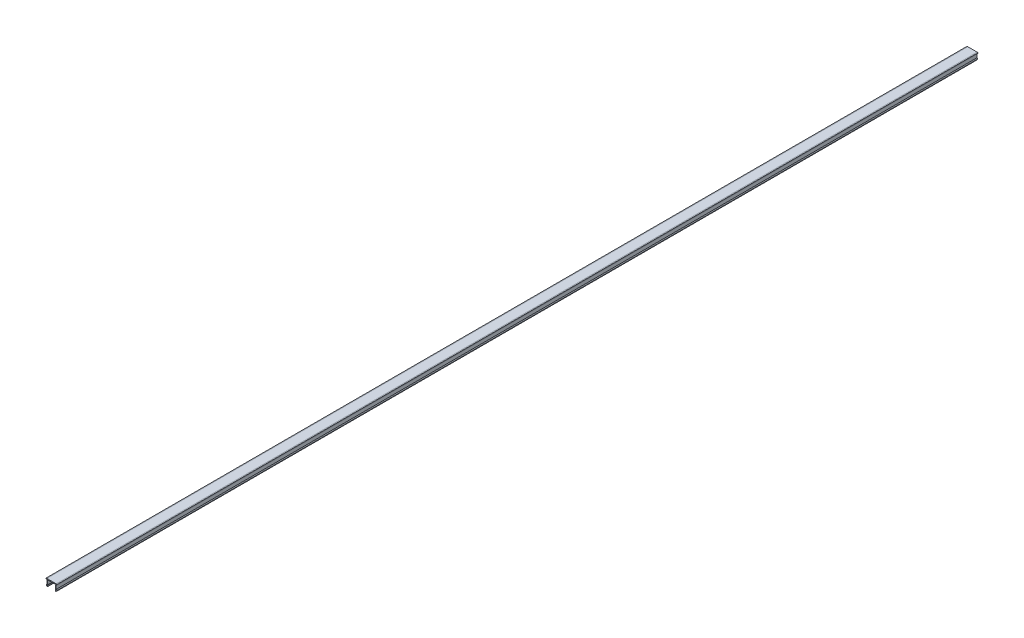
ISO-10303-21;
HEADER;
FILE_DESCRIPTION(('STEP AP214'),'2;1');
FILE_NAME('part.step','',(''),(''),'','','');
FILE_SCHEMA(('AUTOMOTIVE_DESIGN { 1 0 10303 214 1 1 1 1 }'));
ENDSEC;
DATA;
#1=APPLICATION_CONTEXT('core data for automotive mechanical design processes');
#2=APPLICATION_PROTOCOL_DEFINITION('international standard','automotive_design',2000,#1);
#3=PRODUCT_CONTEXT('',#1,'mechanical');
#4=PRODUCT('Part','Part','',(#3));
#5=PRODUCT_RELATED_PRODUCT_CATEGORY('part','',(#4));
#6=PRODUCT_DEFINITION_FORMATION('','',#4);
#7=PRODUCT_DEFINITION_CONTEXT('part definition',#1,'design');
#8=PRODUCT_DEFINITION('design','',#6,#7);
#9=PRODUCT_DEFINITION_SHAPE('','',#8);
#10=(LENGTH_UNIT() NAMED_UNIT(*) SI_UNIT(.MILLI.,.METRE.));
#11=(NAMED_UNIT(*) PLANE_ANGLE_UNIT() SI_UNIT($,.RADIAN.));
#12=(NAMED_UNIT(*) SI_UNIT($,.STERADIAN.) SOLID_ANGLE_UNIT());
#13=UNCERTAINTY_MEASURE_WITH_UNIT(LENGTH_MEASURE(1.E-05),#10,'distance_accuracy_value','');
#14=(GEOMETRIC_REPRESENTATION_CONTEXT(3) GLOBAL_UNCERTAINTY_ASSIGNED_CONTEXT((#13)) GLOBAL_UNIT_ASSIGNED_CONTEXT((#10,
#11,#12)) REPRESENTATION_CONTEXT('',''));
#15=CARTESIAN_POINT('',(0.,0.,0.));
#16=DIRECTION('',(0.,0.,1.));
#17=DIRECTION('',(1.,0.,0.));
#18=AXIS2_PLACEMENT_3D('',#15,#16,#17);
#19=CARTESIAN_POINT('',(-5.1,0.,1000.));
#20=DIRECTION('',(0.,-1.,0.));
#21=DIRECTION('',(1.,0.,0.));
#22=AXIS2_PLACEMENT_3D('',#19,#20,#21);
#23=PLANE('',#22);
#24=DIRECTION('',(-1.,0.,0.));
#25=VECTOR('',#24,1.);
#26=CARTESIAN_POINT('',(-5.1,0.,0.));
#27=LINE('',#26,#25);
#28=CARTESIAN_POINT('',(5.1,0.,0.));
#29=VERTEX_POINT('',#28);
#30=CARTESIAN_POINT('',(-5.1,0.,0.));
#31=VERTEX_POINT('',#30);
#32=EDGE_CURVE('E215',#29,#31,#27,.T.);
#33=ORIENTED_EDGE('',*,*,#32,.T.);
#34=DIRECTION('',(0.,0.,-1.));
#35=VECTOR('',#34,1.);
#36=CARTESIAN_POINT('',(-5.1,0.,1000.));
#37=LINE('',#36,#35);
#38=CARTESIAN_POINT('',(-5.1,0.,1000.));
#39=VERTEX_POINT('',#38);
#40=EDGE_CURVE('E11',#39,#31,#37,.T.);
#41=ORIENTED_EDGE('',*,*,#40,.F.);
#42=DIRECTION('',(-1.,0.,0.));
#43=VECTOR('',#42,1.);
#44=CARTESIAN_POINT('',(-5.1,0.,1000.));
#45=LINE('',#44,#43);
#46=CARTESIAN_POINT('',(5.1,0.,1000.));
#47=VERTEX_POINT('',#46);
#48=EDGE_CURVE('E257',#47,#39,#45,.T.);
#49=ORIENTED_EDGE('',*,*,#48,.F.);
#50=DIRECTION('',(0.,0.,-1.));
#51=VECTOR('',#50,1.);
#52=CARTESIAN_POINT('',(5.1,0.,1000.));
#53=LINE('',#52,#51);
#54=EDGE_CURVE('E211',#47,#29,#53,.T.);
#55=ORIENTED_EDGE('',*,*,#54,.T.);
#56=EDGE_LOOP('',(#33,#41,#49,#55));
#57=FACE_BOUND('',#56,.T.);
#58=ADVANCED_FACE('F35',(#57),#23,.F.);
#59=CARTESIAN_POINT('',(-5.1,0.,1000.));
#60=DIRECTION('',(0.173648177666924,-0.984807753012209,0.));
#61=DIRECTION('',(0.984807753012209,0.173648177666924,0.));
#62=AXIS2_PLACEMENT_3D('',#59,#60,#61);
#63=PLANE('',#62);
#64=DIRECTION('',(-0.984807753012209,-0.173648177666924,0.));
#65=VECTOR('',#64,1.);
#66=CARTESIAN_POINT('',(-5.1,0.,0.));
#67=LINE('',#66,#65);
#68=CARTESIAN_POINT('',(-6.,-0.158694282637612,0.));
#69=VERTEX_POINT('',#68);
#70=EDGE_CURVE('E218',#31,#69,#67,.T.);
#71=ORIENTED_EDGE('',*,*,#70,.T.);
#72=DIRECTION('',(0.,0.,-1.));
#73=VECTOR('',#72,1.);
#74=CARTESIAN_POINT('',(-6.,-0.158694282637612,1000.));
#75=LINE('',#74,#73);
#76=CARTESIAN_POINT('',(-6.,-0.158694282637612,1000.));
#77=VERTEX_POINT('',#76);
#78=EDGE_CURVE('E43',#77,#69,#75,.T.);
#79=ORIENTED_EDGE('',*,*,#78,.F.);
#80=DIRECTION('',(-0.984807753012209,-0.173648177666924,0.));
#81=VECTOR('',#80,1.);
#82=CARTESIAN_POINT('',(-5.1,0.,1000.));
#83=LINE('',#82,#81);
#84=EDGE_CURVE('E136',#39,#77,#83,.T.);
#85=ORIENTED_EDGE('',*,*,#84,.F.);
#86=ORIENTED_EDGE('',*,*,#40,.T.);
#87=EDGE_LOOP('',(#71,#79,#85,#86));
#88=FACE_BOUND('',#87,.T.);
#89=ADVANCED_FACE('F385',(#88),#63,.F.);
#90=CARTESIAN_POINT('',(-6.,-0.158694282637612,1000.));
#91=DIRECTION('',(1.,0.,0.));
#92=DIRECTION('',(0.,0.,-1.));
#93=AXIS2_PLACEMENT_3D('',#90,#91,#92);
#94=PLANE('',#93);
#95=DIRECTION('',(0.,-1.,0.));
#96=VECTOR('',#95,1.);
#97=CARTESIAN_POINT('',(-6.,-0.158694282637612,0.));
#98=LINE('',#97,#96);
#99=CARTESIAN_POINT('',(-6.,-0.8,0.));
#100=VERTEX_POINT('',#99);
#101=EDGE_CURVE('E220',#69,#100,#98,.T.);
#102=ORIENTED_EDGE('',*,*,#101,.T.);
#103=DIRECTION('',(0.,0.,-1.));
#104=VECTOR('',#103,1.);
#105=CARTESIAN_POINT('',(-6.,-0.8,1000.));
#106=LINE('',#105,#104);
#107=CARTESIAN_POINT('',(-6.,-0.8,1000.));
#108=VERTEX_POINT('',#107);
#109=EDGE_CURVE('E306',#108,#100,#106,.T.);
#110=ORIENTED_EDGE('',*,*,#109,.F.);
#111=DIRECTION('',(0.,-1.,0.));
#112=VECTOR('',#111,1.);
#113=CARTESIAN_POINT('',(-6.,-0.158694282637612,1000.));
#114=LINE('',#113,#112);
#115=EDGE_CURVE('E314',#77,#108,#114,.T.);
#116=ORIENTED_EDGE('',*,*,#115,.F.);
#117=ORIENTED_EDGE('',*,*,#78,.T.);
#118=EDGE_LOOP('',(#102,#110,#116,#117));
#119=FACE_BOUND('',#118,.T.);
#120=ADVANCED_FACE('F312',(#119),#94,.F.);
#121=CARTESIAN_POINT('',(-6.,-0.8,1000.));
#122=DIRECTION('',(0.,1.,0.));
#123=DIRECTION('',(0.,0.,1.));
#124=AXIS2_PLACEMENT_3D('',#121,#122,#123);
#125=PLANE('',#124);
#126=DIRECTION('',(1.,0.,0.));
#127=VECTOR('',#126,1.);
#128=CARTESIAN_POINT('',(-6.,-0.8,0.));
#129=LINE('',#128,#127);
#130=CARTESIAN_POINT('',(-5.1,-0.8,0.));
#131=VERTEX_POINT('',#130);
#132=EDGE_CURVE('E222',#100,#131,#129,.T.);
#133=ORIENTED_EDGE('',*,*,#132,.T.);
#134=DIRECTION('',(0.,0.,-1.));
#135=VECTOR('',#134,1.);
#136=CARTESIAN_POINT('',(-5.1,-0.8,1000.));
#137=LINE('',#136,#135);
#138=CARTESIAN_POINT('',(-5.1,-0.8,1000.));
#139=VERTEX_POINT('',#138);
#140=EDGE_CURVE('E303',#139,#131,#137,.T.);
#141=ORIENTED_EDGE('',*,*,#140,.F.);
#142=DIRECTION('',(1.,0.,0.));
#143=VECTOR('',#142,1.);
#144=CARTESIAN_POINT('',(-6.,-0.8,1000.));
#145=LINE('',#144,#143);
#146=EDGE_CURVE('E332',#108,#139,#145,.T.);
#147=ORIENTED_EDGE('',*,*,#146,.F.);
#148=ORIENTED_EDGE('',*,*,#109,.T.);
#149=EDGE_LOOP('',(#133,#141,#147,#148));
#150=FACE_BOUND('',#149,.T.);
#151=ADVANCED_FACE('F323',(#150),#125,.F.);
#152=CARTESIAN_POINT('',(-5.1,-0.8,1000.));
#153=DIRECTION('',(1.,0.,0.));
#154=DIRECTION('',(0.,1.,0.));
#155=AXIS2_PLACEMENT_3D('',#152,#153,#154);
#156=PLANE('',#155);
#157=DIRECTION('',(0.,-1.,0.));
#158=VECTOR('',#157,1.);
#159=CARTESIAN_POINT('',(-5.1,-0.8,0.));
#160=LINE('',#159,#158);
#161=CARTESIAN_POINT('',(-5.1,-5.19615242270663,0.));
#162=VERTEX_POINT('',#161);
#163=EDGE_CURVE('E224',#131,#162,#160,.T.);
#164=ORIENTED_EDGE('',*,*,#163,.T.);
#165=DIRECTION('',(0.,0.,-1.));
#166=VECTOR('',#165,1.);
#167=CARTESIAN_POINT('',(-5.1,-5.19615242270663,1000.));
#168=LINE('',#167,#166);
#169=CARTESIAN_POINT('',(-5.1,-5.19615242270663,1000.));
#170=VERTEX_POINT('',#169);
#171=EDGE_CURVE('E300',#170,#162,#168,.T.);
#172=ORIENTED_EDGE('',*,*,#171,.F.);
#173=DIRECTION('',(0.,-1.,0.));
#174=VECTOR('',#173,1.);
#175=CARTESIAN_POINT('',(-5.1,-0.8,1000.));
#176=LINE('',#175,#174);
#177=EDGE_CURVE('E329',#139,#170,#176,.T.);
#178=ORIENTED_EDGE('',*,*,#177,.F.);
#179=ORIENTED_EDGE('',*,*,#140,.T.);
#180=EDGE_LOOP('',(#164,#172,#178,#179));
#181=FACE_BOUND('',#180,.T.);
#182=ADVANCED_FACE('F327',(#181),#156,.F.);
#183=CARTESIAN_POINT('',(-5.1,-5.19615242270663,1000.));
#184=DIRECTION('',(0.866025403784438,-0.5,0.));
#185=DIRECTION('',(0.5,0.866025403784438,0.));
#186=AXIS2_PLACEMENT_3D('',#183,#184,#185);
#187=PLANE('',#186);
#188=DIRECTION('',(-0.5,-0.866025403784438,0.));
#189=VECTOR('',#188,1.);
#190=CARTESIAN_POINT('',(-5.1,-5.19615242270663,0.));
#191=LINE('',#190,#189);
#192=CARTESIAN_POINT('',(-5.68771324027147,-6.21410161513775,0.));
#193=VERTEX_POINT('',#192);
#194=EDGE_CURVE('E226',#162,#193,#191,.T.);
#195=ORIENTED_EDGE('',*,*,#194,.T.);
#196=DIRECTION('',(0.,0.,-1.));
#197=VECTOR('',#196,1.);
#198=CARTESIAN_POINT('',(-5.68771324027147,-6.21410161513775,1000.));
#199=LINE('',#198,#197);
#200=CARTESIAN_POINT('',(-5.68771324027147,-6.21410161513775,1000.));
#201=VERTEX_POINT('',#200);
#202=EDGE_CURVE('E297',#201,#193,#199,.T.);
#203=ORIENTED_EDGE('',*,*,#202,.F.);
#204=DIRECTION('',(-0.5,-0.866025403784438,0.));
#205=VECTOR('',#204,1.);
#206=CARTESIAN_POINT('',(-5.1,-5.19615242270663,1000.));
#207=LINE('',#206,#205);
#208=EDGE_CURVE('E331',#170,#201,#207,.T.);
#209=ORIENTED_EDGE('',*,*,#208,.F.);
#210=ORIENTED_EDGE('',*,*,#171,.T.);
#211=EDGE_LOOP('',(#195,#203,#209,#210));
#212=FACE_BOUND('',#211,.T.);
#213=ADVANCED_FACE('F398',(#212),#187,.F.);
#214=CARTESIAN_POINT('',(-5.68771324027147,-6.21410161513775,1000.));
#215=DIRECTION('',(0.866025403784438,0.500000000000001,0.));
#216=DIRECTION('',(-0.500000000000001,0.866025403784438,0.));
#217=AXIS2_PLACEMENT_3D('',#214,#215,#216);
#218=PLANE('',#217);
#219=DIRECTION('',(0.500000000000001,-0.866025403784438,0.));
#220=VECTOR('',#219,1.);
#221=CARTESIAN_POINT('',(-5.68771324027147,-6.21410161513775,0.));
#222=LINE('',#221,#220);
#223=CARTESIAN_POINT('',(-5.1,-7.23205080756888,0.));
#224=VERTEX_POINT('',#223);
#225=EDGE_CURVE('E228',#193,#224,#222,.T.);
#226=ORIENTED_EDGE('',*,*,#225,.T.);
#227=DIRECTION('',(0.,0.,-1.));
#228=VECTOR('',#227,1.);
#229=CARTESIAN_POINT('',(-5.1,-7.23205080756888,1000.));
#230=LINE('',#229,#228);
#231=CARTESIAN_POINT('',(-5.1,-7.23205080756888,1000.));
#232=VERTEX_POINT('',#231);
#233=EDGE_CURVE('E294',#232,#224,#230,.T.);
#234=ORIENTED_EDGE('',*,*,#233,.F.);
#235=DIRECTION('',(0.500000000000001,-0.866025403784438,0.));
#236=VECTOR('',#235,1.);
#237=CARTESIAN_POINT('',(-5.68771324027147,-6.21410161513775,1000.));
#238=LINE('',#237,#236);
#239=EDGE_CURVE('E334',#201,#232,#238,.T.);
#240=ORIENTED_EDGE('',*,*,#239,.F.);
#241=ORIENTED_EDGE('',*,*,#202,.T.);
#242=EDGE_LOOP('',(#226,#234,#240,#241));
#243=FACE_BOUND('',#242,.T.);
#244=ADVANCED_FACE('F401',(#243),#218,.F.);
#245=CARTESIAN_POINT('',(-4.63589838486224,-6.96410161513775,1000.));
#246=DIRECTION('',(0.,0.,-1.));
#247=DIRECTION('',(-1.,0.,0.));
#248=AXIS2_PLACEMENT_3D('',#245,#246,#247);
#249=CYLINDRICAL_SURFACE('',#248,0.535898384862246);
#250=CARTESIAN_POINT('',(-4.63589838486224,-6.96410161513775,0.));
#251=DIRECTION('',(0.,0.,1.));
#252=DIRECTION('',(1.,0.,0.));
#253=AXIS2_PLACEMENT_3D('',#250,#251,#252);
#254=CIRCLE('',#253,0.535898384862246);
#255=CARTESIAN_POINT('',(-4.1,-6.96410161513775,0.));
#256=VERTEX_POINT('',#255);
#257=EDGE_CURVE('E230',#224,#256,#254,.T.);
#258=ORIENTED_EDGE('',*,*,#257,.T.);
#259=DIRECTION('',(0.,0.,-1.));
#260=VECTOR('',#259,1.);
#261=CARTESIAN_POINT('',(-4.1,-6.96410161513775,1000.));
#262=LINE('',#261,#260);
#263=CARTESIAN_POINT('',(-4.1,-6.96410161513775,1000.));
#264=VERTEX_POINT('',#263);
#265=EDGE_CURVE('E291',#264,#256,#262,.T.);
#266=ORIENTED_EDGE('',*,*,#265,.F.);
#267=CARTESIAN_POINT('',(-4.63589838486224,-6.96410161513775,1000.));
#268=DIRECTION('',(0.,0.,1.));
#269=DIRECTION('',(1.,0.,0.));
#270=AXIS2_PLACEMENT_3D('',#267,#268,#269);
#271=CIRCLE('',#270,0.535898384862246);
#272=EDGE_CURVE('E340',#232,#264,#271,.T.);
#273=ORIENTED_EDGE('',*,*,#272,.F.);
#274=ORIENTED_EDGE('',*,*,#233,.T.);
#275=EDGE_LOOP('',(#258,#266,#273,#274));
#276=FACE_BOUND('',#275,.T.);
#277=ADVANCED_FACE('F405',(#276),#249,.T.);
#278=CARTESIAN_POINT('',(-4.1,-6.96410161513775,1000.));
#279=DIRECTION('',(-0.866025403784438,-0.500000000000001,0.));
#280=DIRECTION('',(0.500000000000001,-0.866025403784438,0.));
#281=AXIS2_PLACEMENT_3D('',#278,#279,#280);
#282=PLANE('',#281);
#283=DIRECTION('',(-0.500000000000001,0.866025403784438,0.));
#284=VECTOR('',#283,1.);
#285=CARTESIAN_POINT('',(-4.1,-6.96410161513775,0.));
#286=LINE('',#285,#284);
#287=CARTESIAN_POINT('',(-4.53301270189222,-6.21410161513775,0.));
#288=VERTEX_POINT('',#287);
#289=EDGE_CURVE('E232',#256,#288,#286,.T.);
#290=ORIENTED_EDGE('',*,*,#289,.T.);
#291=DIRECTION('',(0.,0.,-1.));
#292=VECTOR('',#291,1.);
#293=CARTESIAN_POINT('',(-4.53301270189222,-6.21410161513775,1000.));
#294=LINE('',#293,#292);
#295=CARTESIAN_POINT('',(-4.53301270189222,-6.21410161513775,1000.));
#296=VERTEX_POINT('',#295);
#297=EDGE_CURVE('E288',#296,#288,#294,.T.);
#298=ORIENTED_EDGE('',*,*,#297,.F.);
#299=DIRECTION('',(-0.500000000000001,0.866025403784438,0.));
#300=VECTOR('',#299,1.);
#301=CARTESIAN_POINT('',(-4.1,-6.96410161513775,1000.));
#302=LINE('',#301,#300);
#303=EDGE_CURVE('E342',#264,#296,#302,.T.);
#304=ORIENTED_EDGE('',*,*,#303,.F.);
#305=ORIENTED_EDGE('',*,*,#265,.T.);
#306=EDGE_LOOP('',(#290,#298,#304,#305));
#307=FACE_BOUND('',#306,.T.);
#308=ADVANCED_FACE('F409',(#307),#282,.F.);
#309=CARTESIAN_POINT('',(-4.53301270189222,-6.21410161513775,1000.));
#310=DIRECTION('',(-0.866025403784438,0.500000000000001,0.));
#311=DIRECTION('',(-0.500000000000001,-0.866025403784438,0.));
#312=AXIS2_PLACEMENT_3D('',#309,#310,#311);
#313=PLANE('',#312);
#314=DIRECTION('',(0.500000000000001,0.866025403784438,0.));
#315=VECTOR('',#314,1.);
#316=CARTESIAN_POINT('',(-4.53301270189222,-6.21410161513775,0.));
#317=LINE('',#316,#315);
#318=CARTESIAN_POINT('',(-4.1,-5.46410161513775,0.));
#319=VERTEX_POINT('',#318);
#320=EDGE_CURVE('E234',#288,#319,#317,.T.);
#321=ORIENTED_EDGE('',*,*,#320,.T.);
#322=DIRECTION('',(0.,0.,-1.));
#323=VECTOR('',#322,1.);
#324=CARTESIAN_POINT('',(-4.1,-5.46410161513775,1000.));
#325=LINE('',#324,#323);
#326=CARTESIAN_POINT('',(-4.1,-5.46410161513775,1000.));
#327=VERTEX_POINT('',#326);
#328=EDGE_CURVE('E285',#327,#319,#325,.T.);
#329=ORIENTED_EDGE('',*,*,#328,.F.);
#330=DIRECTION('',(0.500000000000001,0.866025403784438,0.));
#331=VECTOR('',#330,1.);
#332=CARTESIAN_POINT('',(-4.53301270189222,-6.21410161513775,1000.));
#333=LINE('',#332,#331);
#334=EDGE_CURVE('E344',#296,#327,#333,.T.);
#335=ORIENTED_EDGE('',*,*,#334,.F.);
#336=ORIENTED_EDGE('',*,*,#297,.T.);
#337=EDGE_LOOP('',(#321,#329,#335,#336));
#338=FACE_BOUND('',#337,.T.);
#339=ADVANCED_FACE('F413',(#338),#313,.F.);
#340=CARTESIAN_POINT('',(-4.1,-5.46410161513775,1000.));
#341=DIRECTION('',(-1.,0.,0.));
#342=DIRECTION('',(0.,-1.,0.));
#343=AXIS2_PLACEMENT_3D('',#340,#341,#342);
#344=PLANE('',#343);
#345=DIRECTION('',(0.,1.,0.));
#346=VECTOR('',#345,1.);
#347=CARTESIAN_POINT('',(-4.1,-5.46410161513775,0.));
#348=LINE('',#347,#346);
#349=CARTESIAN_POINT('',(-4.1,-1.,0.));
#350=VERTEX_POINT('',#349);
#351=EDGE_CURVE('E236',#319,#350,#348,.T.);
#352=ORIENTED_EDGE('',*,*,#351,.T.);
#353=DIRECTION('',(0.,0.,-1.));
#354=VECTOR('',#353,1.);
#355=CARTESIAN_POINT('',(-4.1,-1.,1000.));
#356=LINE('',#355,#354);
#357=CARTESIAN_POINT('',(-4.1,-1.,1000.));
#358=VERTEX_POINT('',#357);
#359=EDGE_CURVE('E282',#358,#350,#356,.T.);
#360=ORIENTED_EDGE('',*,*,#359,.F.);
#361=DIRECTION('',(0.,1.,0.));
#362=VECTOR('',#361,1.);
#363=CARTESIAN_POINT('',(-4.1,-5.46410161513775,1000.));
#364=LINE('',#363,#362);
#365=EDGE_CURVE('E346',#327,#358,#364,.T.);
#366=ORIENTED_EDGE('',*,*,#365,.F.);
#367=ORIENTED_EDGE('',*,*,#328,.T.);
#368=EDGE_LOOP('',(#352,#360,#366,#367));
#369=FACE_BOUND('',#368,.T.);
#370=ADVANCED_FACE('F417',(#369),#344,.F.);
#371=CARTESIAN_POINT('',(-4.1,-1.,1000.));
#372=DIRECTION('',(0.,1.,0.));
#373=DIRECTION('',(-1.,0.,0.));
#374=AXIS2_PLACEMENT_3D('',#371,#372,#373);
#375=PLANE('',#374);
#376=DIRECTION('',(1.,0.,0.));
#377=VECTOR('',#376,1.);
#378=CARTESIAN_POINT('',(-4.1,-1.,0.));
#379=LINE('',#378,#377);
#380=CARTESIAN_POINT('',(4.1,-0.999999999999999,0.));
#381=VERTEX_POINT('',#380);
#382=EDGE_CURVE('E238',#350,#381,#379,.T.);
#383=ORIENTED_EDGE('',*,*,#382,.T.);
#384=DIRECTION('',(0.,0.,-1.));
#385=VECTOR('',#384,1.);
#386=CARTESIAN_POINT('',(4.1,-0.999999999999999,1000.));
#387=LINE('',#386,#385);
#388=CARTESIAN_POINT('',(4.1,-0.999999999999999,1000.));
#389=VERTEX_POINT('',#388);
#390=EDGE_CURVE('E279',#389,#381,#387,.T.);
#391=ORIENTED_EDGE('',*,*,#390,.F.);
#392=DIRECTION('',(1.,0.,0.));
#393=VECTOR('',#392,1.);
#394=CARTESIAN_POINT('',(-4.1,-1.,1000.));
#395=LINE('',#394,#393);
#396=EDGE_CURVE('E348',#358,#389,#395,.T.);
#397=ORIENTED_EDGE('',*,*,#396,.F.);
#398=ORIENTED_EDGE('',*,*,#359,.T.);
#399=EDGE_LOOP('',(#383,#391,#397,#398));
#400=FACE_BOUND('',#399,.T.);
#401=ADVANCED_FACE('F421',(#400),#375,.F.);
#402=CARTESIAN_POINT('',(4.1,-5.46410161513775,1000.));
#403=DIRECTION('',(1.,0.,0.));
#404=DIRECTION('',(0.,1.,0.));
#405=AXIS2_PLACEMENT_3D('',#402,#403,#404);
#406=PLANE('',#405);
#407=DIRECTION('',(0.,-1.,0.));
#408=VECTOR('',#407,1.);
#409=CARTESIAN_POINT('',(4.1,-5.46410161513775,0.));
#410=LINE('',#409,#408);
#411=CARTESIAN_POINT('',(4.1,-5.46410161513775,0.));
#412=VERTEX_POINT('',#411);
#413=EDGE_CURVE('E240',#381,#412,#410,.T.);
#414=ORIENTED_EDGE('',*,*,#413,.T.);
#415=DIRECTION('',(0.,0.,-1.));
#416=VECTOR('',#415,1.);
#417=CARTESIAN_POINT('',(4.1,-5.46410161513775,1000.));
#418=LINE('',#417,#416);
#419=CARTESIAN_POINT('',(4.1,-5.46410161513775,1000.));
#420=VERTEX_POINT('',#419);
#421=EDGE_CURVE('E276',#420,#412,#418,.T.);
#422=ORIENTED_EDGE('',*,*,#421,.F.);
#423=DIRECTION('',(0.,-1.,0.));
#424=VECTOR('',#423,1.);
#425=CARTESIAN_POINT('',(4.1,-5.46410161513775,1000.));
#426=LINE('',#425,#424);
#427=EDGE_CURVE('E350',#389,#420,#426,.T.);
#428=ORIENTED_EDGE('',*,*,#427,.F.);
#429=ORIENTED_EDGE('',*,*,#390,.T.);
#430=EDGE_LOOP('',(#414,#422,#428,#429));
#431=FACE_BOUND('',#430,.T.);
#432=ADVANCED_FACE('F425',(#431),#406,.F.);
#433=CARTESIAN_POINT('',(4.53301270189222,-6.21410161513775,1000.));
#434=DIRECTION('',(0.866025403784438,0.500000000000001,0.));
#435=DIRECTION('',(-0.500000000000001,0.866025403784438,0.));
#436=AXIS2_PLACEMENT_3D('',#433,#434,#435);
#437=PLANE('',#436);
#438=DIRECTION('',(0.500000000000001,-0.866025403784438,0.));
#439=VECTOR('',#438,1.);
#440=CARTESIAN_POINT('',(4.53301270189222,-6.21410161513775,0.));
#441=LINE('',#440,#439);
#442=CARTESIAN_POINT('',(4.53301270189222,-6.21410161513775,0.));
#443=VERTEX_POINT('',#442);
#444=EDGE_CURVE('E242',#412,#443,#441,.T.);
#445=ORIENTED_EDGE('',*,*,#444,.T.);
#446=DIRECTION('',(0.,0.,-1.));
#447=VECTOR('',#446,1.);
#448=CARTESIAN_POINT('',(4.53301270189222,-6.21410161513775,1000.));
#449=LINE('',#448,#447);
#450=CARTESIAN_POINT('',(4.53301270189222,-6.21410161513775,1000.));
#451=VERTEX_POINT('',#450);
#452=EDGE_CURVE('E273',#451,#443,#449,.T.);
#453=ORIENTED_EDGE('',*,*,#452,.F.);
#454=DIRECTION('',(0.500000000000001,-0.866025403784438,0.));
#455=VECTOR('',#454,1.);
#456=CARTESIAN_POINT('',(4.53301270189222,-6.21410161513775,1000.));
#457=LINE('',#456,#455);
#458=EDGE_CURVE('E352',#420,#451,#457,.T.);
#459=ORIENTED_EDGE('',*,*,#458,.F.);
#460=ORIENTED_EDGE('',*,*,#421,.T.);
#461=EDGE_LOOP('',(#445,#453,#459,#460));
#462=FACE_BOUND('',#461,.T.);
#463=ADVANCED_FACE('F429',(#462),#437,.F.);
#464=CARTESIAN_POINT('',(4.1,-6.96410161513775,1000.));
#465=DIRECTION('',(0.866025403784438,-0.500000000000001,0.));
#466=DIRECTION('',(0.500000000000001,0.866025403784438,0.));
#467=AXIS2_PLACEMENT_3D('',#464,#465,#466);
#468=PLANE('',#467);
#469=DIRECTION('',(-0.500000000000001,-0.866025403784438,0.));
#470=VECTOR('',#469,1.);
#471=CARTESIAN_POINT('',(4.1,-6.96410161513775,0.));
#472=LINE('',#471,#470);
#473=CARTESIAN_POINT('',(4.1,-6.96410161513775,0.));
#474=VERTEX_POINT('',#473);
#475=EDGE_CURVE('E244',#443,#474,#472,.T.);
#476=ORIENTED_EDGE('',*,*,#475,.T.);
#477=DIRECTION('',(0.,0.,-1.));
#478=VECTOR('',#477,1.);
#479=CARTESIAN_POINT('',(4.1,-6.96410161513775,1000.));
#480=LINE('',#479,#478);
#481=CARTESIAN_POINT('',(4.1,-6.96410161513775,1000.));
#482=VERTEX_POINT('',#481);
#483=EDGE_CURVE('E270',#482,#474,#480,.T.);
#484=ORIENTED_EDGE('',*,*,#483,.F.);
#485=DIRECTION('',(-0.500000000000001,-0.866025403784438,0.));
#486=VECTOR('',#485,1.);
#487=CARTESIAN_POINT('',(4.1,-6.96410161513775,1000.));
#488=LINE('',#487,#486);
#489=EDGE_CURVE('E354',#451,#482,#488,.T.);
#490=ORIENTED_EDGE('',*,*,#489,.F.);
#491=ORIENTED_EDGE('',*,*,#452,.T.);
#492=EDGE_LOOP('',(#476,#484,#490,#491));
#493=FACE_BOUND('',#492,.T.);
#494=ADVANCED_FACE('F433',(#493),#468,.F.);
#495=CARTESIAN_POINT('',(4.63589838486224,-6.96410161513775,1000.));
#496=DIRECTION('',(0.,0.,-1.));
#497=DIRECTION('',(-1.,0.,0.));
#498=AXIS2_PLACEMENT_3D('',#495,#496,#497);
#499=CYLINDRICAL_SURFACE('',#498,0.535898384862246);
#500=CARTESIAN_POINT('',(4.63589838486224,-6.96410161513775,0.));
#501=DIRECTION('',(0.,0.,1.));
#502=DIRECTION('',(-1.,0.,0.));
#503=AXIS2_PLACEMENT_3D('',#500,#501,#502);
#504=CIRCLE('',#503,0.535898384862246);
#505=CARTESIAN_POINT('',(5.1,-7.23205080756888,0.));
#506=VERTEX_POINT('',#505);
#507=EDGE_CURVE('E246',#474,#506,#504,.T.);
#508=ORIENTED_EDGE('',*,*,#507,.T.);
#509=DIRECTION('',(0.,0.,-1.));
#510=VECTOR('',#509,1.);
#511=CARTESIAN_POINT('',(5.1,-7.23205080756888,1000.));
#512=LINE('',#511,#510);
#513=CARTESIAN_POINT('',(5.1,-7.23205080756888,1000.));
#514=VERTEX_POINT('',#513);
#515=EDGE_CURVE('E267',#514,#506,#512,.T.);
#516=ORIENTED_EDGE('',*,*,#515,.F.);
#517=CARTESIAN_POINT('',(4.63589838486224,-6.96410161513775,1000.));
#518=DIRECTION('',(0.,0.,1.));
#519=DIRECTION('',(-1.,0.,0.));
#520=AXIS2_PLACEMENT_3D('',#517,#518,#519);
#521=CIRCLE('',#520,0.535898384862246);
#522=EDGE_CURVE('E356',#482,#514,#521,.T.);
#523=ORIENTED_EDGE('',*,*,#522,.F.);
#524=ORIENTED_EDGE('',*,*,#483,.T.);
#525=EDGE_LOOP('',(#508,#516,#523,#524));
#526=FACE_BOUND('',#525,.T.);
#527=ADVANCED_FACE('F437',(#526),#499,.T.);
#528=CARTESIAN_POINT('',(5.68771324027147,-6.21410161513775,1000.));
#529=DIRECTION('',(-0.866025403784438,0.500000000000001,0.));
#530=DIRECTION('',(-0.500000000000001,-0.866025403784438,0.));
#531=AXIS2_PLACEMENT_3D('',#528,#529,#530);
#532=PLANE('',#531);
#533=DIRECTION('',(0.500000000000001,0.866025403784438,0.));
#534=VECTOR('',#533,1.);
#535=CARTESIAN_POINT('',(5.68771324027147,-6.21410161513775,0.));
#536=LINE('',#535,#534);
#537=CARTESIAN_POINT('',(5.68771324027147,-6.21410161513775,0.));
#538=VERTEX_POINT('',#537);
#539=EDGE_CURVE('E248',#506,#538,#536,.T.);
#540=ORIENTED_EDGE('',*,*,#539,.T.);
#541=DIRECTION('',(0.,0.,-1.));
#542=VECTOR('',#541,1.);
#543=CARTESIAN_POINT('',(5.68771324027147,-6.21410161513775,1000.));
#544=LINE('',#543,#542);
#545=CARTESIAN_POINT('',(5.68771324027147,-6.21410161513775,1000.));
#546=VERTEX_POINT('',#545);
#547=EDGE_CURVE('E264',#546,#538,#544,.T.);
#548=ORIENTED_EDGE('',*,*,#547,.F.);
#549=DIRECTION('',(0.500000000000001,0.866025403784438,0.));
#550=VECTOR('',#549,1.);
#551=CARTESIAN_POINT('',(5.68771324027147,-6.21410161513775,1000.));
#552=LINE('',#551,#550);
#553=EDGE_CURVE('E358',#514,#546,#552,.T.);
#554=ORIENTED_EDGE('',*,*,#553,.F.);
#555=ORIENTED_EDGE('',*,*,#515,.T.);
#556=EDGE_LOOP('',(#540,#548,#554,#555));
#557=FACE_BOUND('',#556,.T.);
#558=ADVANCED_FACE('F441',(#557),#532,.F.);
#559=CARTESIAN_POINT('',(5.1,-5.19615242270663,1000.));
#560=DIRECTION('',(-0.866025403784438,-0.500000000000001,0.));
#561=DIRECTION('',(0.500000000000001,-0.866025403784438,0.));
#562=AXIS2_PLACEMENT_3D('',#559,#560,#561);
#563=PLANE('',#562);
#564=DIRECTION('',(-0.500000000000001,0.866025403784438,0.));
#565=VECTOR('',#564,1.);
#566=CARTESIAN_POINT('',(5.1,-5.19615242270663,0.));
#567=LINE('',#566,#565);
#568=CARTESIAN_POINT('',(5.1,-5.19615242270663,0.));
#569=VERTEX_POINT('',#568);
#570=EDGE_CURVE('E250',#538,#569,#567,.T.);
#571=ORIENTED_EDGE('',*,*,#570,.T.);
#572=DIRECTION('',(0.,0.,-1.));
#573=VECTOR('',#572,1.);
#574=CARTESIAN_POINT('',(5.1,-5.19615242270663,1000.));
#575=LINE('',#574,#573);
#576=CARTESIAN_POINT('',(5.1,-5.19615242270663,1000.));
#577=VERTEX_POINT('',#576);
#578=EDGE_CURVE('E261',#577,#569,#575,.T.);
#579=ORIENTED_EDGE('',*,*,#578,.F.);
#580=DIRECTION('',(-0.500000000000001,0.866025403784438,0.));
#581=VECTOR('',#580,1.);
#582=CARTESIAN_POINT('',(5.1,-5.19615242270663,1000.));
#583=LINE('',#582,#581);
#584=EDGE_CURVE('E360',#546,#577,#583,.T.);
#585=ORIENTED_EDGE('',*,*,#584,.F.);
#586=ORIENTED_EDGE('',*,*,#547,.T.);
#587=EDGE_LOOP('',(#571,#579,#585,#586));
#588=FACE_BOUND('',#587,.T.);
#589=ADVANCED_FACE('F366',(#588),#563,.F.);
#590=CARTESIAN_POINT('',(5.1,-0.799999999999999,1000.));
#591=DIRECTION('',(-1.,0.,0.));
#592=DIRECTION('',(0.,-1.,0.));
#593=AXIS2_PLACEMENT_3D('',#590,#591,#592);
#594=PLANE('',#593);
#595=DIRECTION('',(0.,1.,0.));
#596=VECTOR('',#595,1.);
#597=CARTESIAN_POINT('',(5.1,-0.799999999999999,0.));
#598=LINE('',#597,#596);
#599=CARTESIAN_POINT('',(5.1,-0.799999999999999,0.));
#600=VERTEX_POINT('',#599);
#601=EDGE_CURVE('E252',#569,#600,#598,.T.);
#602=ORIENTED_EDGE('',*,*,#601,.T.);
#603=DIRECTION('',(0.,0.,-1.));
#604=VECTOR('',#603,1.);
#605=CARTESIAN_POINT('',(5.1,-0.799999999999999,1000.));
#606=LINE('',#605,#604);
#607=CARTESIAN_POINT('',(5.1,-0.799999999999999,1000.));
#608=VERTEX_POINT('',#607);
#609=EDGE_CURVE('E206',#608,#600,#606,.T.);
#610=ORIENTED_EDGE('',*,*,#609,.F.);
#611=DIRECTION('',(0.,1.,0.));
#612=VECTOR('',#611,1.);
#613=CARTESIAN_POINT('',(5.1,-0.799999999999999,1000.));
#614=LINE('',#613,#612);
#615=EDGE_CURVE('E197',#577,#608,#614,.T.);
#616=ORIENTED_EDGE('',*,*,#615,.F.);
#617=ORIENTED_EDGE('',*,*,#578,.T.);
#618=EDGE_LOOP('',(#602,#610,#616,#617));
#619=FACE_BOUND('',#618,.T.);
#620=ADVANCED_FACE('F370',(#619),#594,.F.);
#621=CARTESIAN_POINT('',(6.,-0.799999999999998,1000.));
#622=DIRECTION('',(0.,1.,0.));
#623=DIRECTION('',(-1.,0.,0.));
#624=AXIS2_PLACEMENT_3D('',#621,#622,#623);
#625=PLANE('',#624);
#626=DIRECTION('',(1.,0.,0.));
#627=VECTOR('',#626,1.);
#628=CARTESIAN_POINT('',(6.,-0.799999999999998,0.));
#629=LINE('',#628,#627);
#630=CARTESIAN_POINT('',(6.,-0.799999999999998,0.));
#631=VERTEX_POINT('',#630);
#632=EDGE_CURVE('E205',#600,#631,#629,.T.);
#633=ORIENTED_EDGE('',*,*,#632,.T.);
#634=DIRECTION('',(0.,0.,-1.));
#635=VECTOR('',#634,1.);
#636=CARTESIAN_POINT('',(6.,-0.799999999999998,1000.));
#637=LINE('',#636,#635);
#638=CARTESIAN_POINT('',(6.,-0.799999999999998,1000.));
#639=VERTEX_POINT('',#638);
#640=EDGE_CURVE('E202',#639,#631,#637,.T.);
#641=ORIENTED_EDGE('',*,*,#640,.F.);
#642=DIRECTION('',(1.,0.,0.));
#643=VECTOR('',#642,1.);
#644=CARTESIAN_POINT('',(6.,-0.799999999999998,1000.));
#645=LINE('',#644,#643);
#646=EDGE_CURVE('E191',#608,#639,#645,.T.);
#647=ORIENTED_EDGE('',*,*,#646,.F.);
#648=ORIENTED_EDGE('',*,*,#609,.T.);
#649=EDGE_LOOP('',(#633,#641,#647,#648));
#650=FACE_BOUND('',#649,.T.);
#651=ADVANCED_FACE('F203',(#650),#625,.F.);
#652=CARTESIAN_POINT('',(6.,-0.158694282637611,1000.));
#653=DIRECTION('',(-1.,0.,0.));
#654=DIRECTION('',(0.,0.,1.));
#655=AXIS2_PLACEMENT_3D('',#652,#653,#654);
#656=PLANE('',#655);
#657=DIRECTION('',(0.,1.,0.));
#658=VECTOR('',#657,1.);
#659=CARTESIAN_POINT('',(6.,-0.158694282637611,0.));
#660=LINE('',#659,#658);
#661=CARTESIAN_POINT('',(6.,-0.158694282637611,0.));
#662=VERTEX_POINT('',#661);
#663=EDGE_CURVE('E122',#631,#662,#660,.T.);
#664=ORIENTED_EDGE('',*,*,#663,.T.);
#665=DIRECTION('',(0.,0.,-1.));
#666=VECTOR('',#665,1.);
#667=CARTESIAN_POINT('',(6.,-0.158694282637611,1000.));
#668=LINE('',#667,#666);
#669=CARTESIAN_POINT('',(6.,-0.158694282637611,1000.));
#670=VERTEX_POINT('',#669);
#671=EDGE_CURVE('E207',#670,#662,#668,.T.);
#672=ORIENTED_EDGE('',*,*,#671,.F.);
#673=DIRECTION('',(0.,1.,0.));
#674=VECTOR('',#673,1.);
#675=CARTESIAN_POINT('',(6.,-0.158694282637611,1000.));
#676=LINE('',#675,#674);
#677=EDGE_CURVE('E195',#639,#670,#676,.T.);
#678=ORIENTED_EDGE('',*,*,#677,.F.);
#679=ORIENTED_EDGE('',*,*,#640,.T.);
#680=EDGE_LOOP('',(#664,#672,#678,#679));
#681=FACE_BOUND('',#680,.T.);
#682=ADVANCED_FACE('F209',(#681),#656,.F.);
#683=CARTESIAN_POINT('',(5.1,0.,1000.));
#684=DIRECTION('',(-0.173648177666923,-0.984807753012209,0.));
#685=DIRECTION('',(0.984807753012209,-0.173648177666923,0.));
#686=AXIS2_PLACEMENT_3D('',#683,#684,#685);
#687=PLANE('',#686);
#688=DIRECTION('',(-0.984807753012209,0.173648177666923,0.));
#689=VECTOR('',#688,1.);
#690=CARTESIAN_POINT('',(5.1,0.,0.));
#691=LINE('',#690,#689);
#692=EDGE_CURVE('E128',#662,#29,#691,.T.);
#693=ORIENTED_EDGE('',*,*,#692,.T.);
#694=ORIENTED_EDGE('',*,*,#54,.F.);
#695=DIRECTION('',(-0.984807753012209,0.173648177666923,0.));
#696=VECTOR('',#695,1.);
#697=CARTESIAN_POINT('',(5.1,0.,1000.));
#698=LINE('',#697,#696);
#699=EDGE_CURVE('E51',#670,#47,#698,.T.);
#700=ORIENTED_EDGE('',*,*,#699,.F.);
#701=ORIENTED_EDGE('',*,*,#671,.T.);
#702=EDGE_LOOP('',(#693,#694,#700,#701));
#703=FACE_BOUND('',#702,.T.);
#704=ADVANCED_FACE('F374',(#703),#687,.F.);
#705=CARTESIAN_POINT('',(4.63589838486224,-6.96410161513775,1000.));
#706=DIRECTION('',(0.,0.,-1.));
#707=DIRECTION('',(-1.,0.,0.));
#708=AXIS2_PLACEMENT_3D('',#705,#706,#707);
#709=PLANE('',#708);
#710=ORIENTED_EDGE('',*,*,#48,.T.);
#711=ORIENTED_EDGE('',*,*,#84,.T.);
#712=ORIENTED_EDGE('',*,*,#115,.T.);
#713=ORIENTED_EDGE('',*,*,#146,.T.);
#714=ORIENTED_EDGE('',*,*,#177,.T.);
#715=ORIENTED_EDGE('',*,*,#208,.T.);
#716=ORIENTED_EDGE('',*,*,#239,.T.);
#717=ORIENTED_EDGE('',*,*,#272,.T.);
#718=ORIENTED_EDGE('',*,*,#303,.T.);
#719=ORIENTED_EDGE('',*,*,#334,.T.);
#720=ORIENTED_EDGE('',*,*,#365,.T.);
#721=ORIENTED_EDGE('',*,*,#396,.T.);
#722=ORIENTED_EDGE('',*,*,#427,.T.);
#723=ORIENTED_EDGE('',*,*,#458,.T.);
#724=ORIENTED_EDGE('',*,*,#489,.T.);
#725=ORIENTED_EDGE('',*,*,#522,.T.);
#726=ORIENTED_EDGE('',*,*,#553,.T.);
#727=ORIENTED_EDGE('',*,*,#584,.T.);
#728=ORIENTED_EDGE('',*,*,#615,.T.);
#729=ORIENTED_EDGE('',*,*,#646,.T.);
#730=ORIENTED_EDGE('',*,*,#677,.T.);
#731=ORIENTED_EDGE('',*,*,#699,.T.);
#732=EDGE_LOOP('',(#710,#711,#712,#713,#714,#715,#716,#717,#718,#719,#720,#721,#722,#723,#724,
#725,#726,#727,#728,#729,#730,#731));
#733=FACE_BOUND('',#732,.T.);
#734=ADVANCED_FACE('F193',(#733),#709,.F.);
#735=CARTESIAN_POINT('',(4.63589838486224,-6.96410161513775,0.));
#736=DIRECTION('',(0.,0.,-1.));
#737=DIRECTION('',(-1.,0.,0.));
#738=AXIS2_PLACEMENT_3D('',#735,#736,#737);
#739=PLANE('',#738);
#740=ORIENTED_EDGE('',*,*,#32,.F.);
#741=ORIENTED_EDGE('',*,*,#692,.F.);
#742=ORIENTED_EDGE('',*,*,#663,.F.);
#743=ORIENTED_EDGE('',*,*,#632,.F.);
#744=ORIENTED_EDGE('',*,*,#601,.F.);
#745=ORIENTED_EDGE('',*,*,#570,.F.);
#746=ORIENTED_EDGE('',*,*,#539,.F.);
#747=ORIENTED_EDGE('',*,*,#507,.F.);
#748=ORIENTED_EDGE('',*,*,#475,.F.);
#749=ORIENTED_EDGE('',*,*,#444,.F.);
#750=ORIENTED_EDGE('',*,*,#413,.F.);
#751=ORIENTED_EDGE('',*,*,#382,.F.);
#752=ORIENTED_EDGE('',*,*,#351,.F.);
#753=ORIENTED_EDGE('',*,*,#320,.F.);
#754=ORIENTED_EDGE('',*,*,#289,.F.);
#755=ORIENTED_EDGE('',*,*,#257,.F.);
#756=ORIENTED_EDGE('',*,*,#225,.F.);
#757=ORIENTED_EDGE('',*,*,#194,.F.);
#758=ORIENTED_EDGE('',*,*,#163,.F.);
#759=ORIENTED_EDGE('',*,*,#132,.F.);
#760=ORIENTED_EDGE('',*,*,#101,.F.);
#761=ORIENTED_EDGE('',*,*,#70,.F.);
#762=EDGE_LOOP('',(#740,#741,#742,#743,#744,#745,#746,#747,#748,#749,#750,#751,#752,#753,#754,
#755,#756,#757,#758,#759,#760,#761));
#763=FACE_BOUND('',#762,.T.);
#764=ADVANCED_FACE('F318',(#763),#739,.T.);
#765=CLOSED_SHELL('',(#58,#89,#120,#151,#182,#213,#244,#277,#308,#339,#370,#401,#432,#463,#494,
#527,#558,#589,#620,#651,#682,#704,#734,#764));
#766=MANIFOLD_SOLID_BREP('B2',#765);
#767=ADVANCED_BREP_SHAPE_REPRESENTATION('',(#18,#766),#14);
#768=SHAPE_DEFINITION_REPRESENTATION(#9,#767);
ENDSEC;
END-ISO-10303-21;
